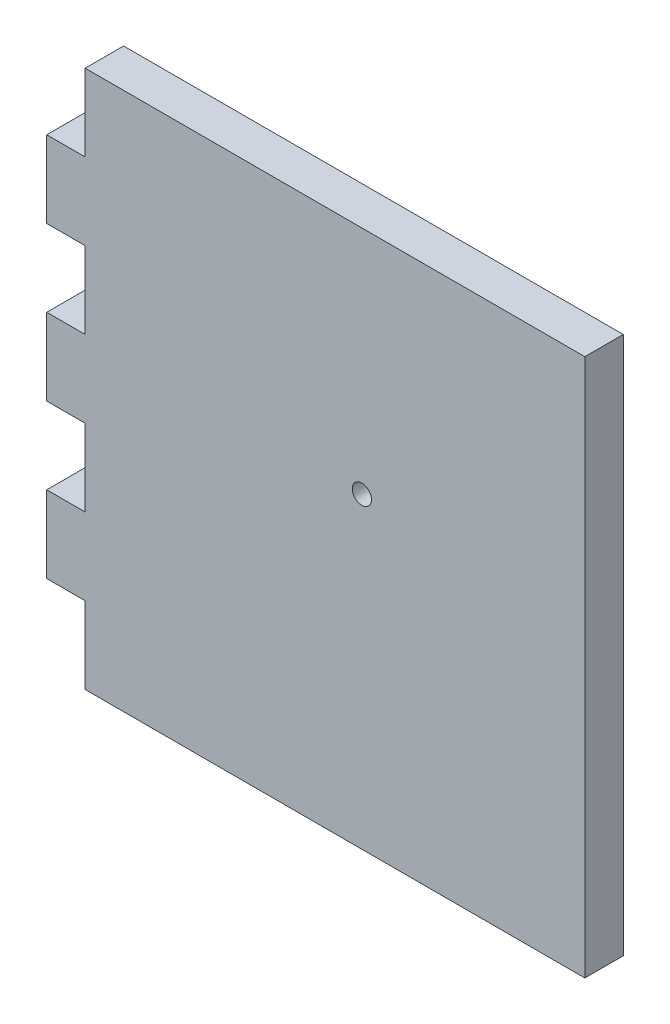
ISO-10303-21;
HEADER;
FILE_DESCRIPTION(('STEP AP214'),'2;1');
FILE_NAME('part.step','',(''),(''),'','','');
FILE_SCHEMA(('AUTOMOTIVE_DESIGN { 1 0 10303 214 1 1 1 1 }'));
ENDSEC;
DATA;
#1=APPLICATION_CONTEXT('core data for automotive mechanical design processes');
#2=APPLICATION_PROTOCOL_DEFINITION('international standard','automotive_design',2000,#1);
#3=PRODUCT_CONTEXT('',#1,'mechanical');
#4=PRODUCT('Part','Part','',(#3));
#5=PRODUCT_RELATED_PRODUCT_CATEGORY('part','',(#4));
#6=PRODUCT_DEFINITION_FORMATION('','',#4);
#7=PRODUCT_DEFINITION_CONTEXT('part definition',#1,'design');
#8=PRODUCT_DEFINITION('design','',#6,#7);
#9=PRODUCT_DEFINITION_SHAPE('','',#8);
#10=(LENGTH_UNIT() NAMED_UNIT(*) SI_UNIT(.MILLI.,.METRE.));
#11=(NAMED_UNIT(*) PLANE_ANGLE_UNIT() SI_UNIT($,.RADIAN.));
#12=(NAMED_UNIT(*) SI_UNIT($,.STERADIAN.) SOLID_ANGLE_UNIT());
#13=UNCERTAINTY_MEASURE_WITH_UNIT(LENGTH_MEASURE(1.E-05),#10,'distance_accuracy_value','');
#14=(GEOMETRIC_REPRESENTATION_CONTEXT(3) GLOBAL_UNCERTAINTY_ASSIGNED_CONTEXT((#13)) GLOBAL_UNIT_ASSIGNED_CONTEXT((#10,
#11,#12)) REPRESENTATION_CONTEXT('',''));
#15=CARTESIAN_POINT('',(0.,0.,0.));
#16=DIRECTION('',(0.,0.,1.));
#17=DIRECTION('',(1.,0.,0.));
#18=AXIS2_PLACEMENT_3D('',#15,#16,#17);
#19=CARTESIAN_POINT('',(0.,0.,12.7));
#20=DIRECTION('',(1.,0.,0.));
#21=DIRECTION('',(0.,1.,0.));
#22=AXIS2_PLACEMENT_3D('',#19,#20,#21);
#23=PLANE('',#22);
#24=DIRECTION('',(0.,-1.,0.));
#25=VECTOR('',#24,1.);
#26=CARTESIAN_POINT('',(0.,0.,12.7));
#27=LINE('',#26,#25);
#28=CARTESIAN_POINT('',(0.,-25.4,12.7));
#29=VERTEX_POINT('',#28);
#30=CARTESIAN_POINT('',(0.,-50.8,12.7));
#31=VERTEX_POINT('',#30);
#32=EDGE_CURVE('E306',#29,#31,#27,.T.);
#33=ORIENTED_EDGE('',*,*,#32,.F.);
#34=DIRECTION('',(0.,0.,1.));
#35=VECTOR('',#34,1.);
#36=CARTESIAN_POINT('',(0.,-25.4,0.));
#37=LINE('',#36,#35);
#38=CARTESIAN_POINT('',(0.,-25.4,0.));
#39=VERTEX_POINT('',#38);
#40=EDGE_CURVE('E193',#39,#29,#37,.T.);
#41=ORIENTED_EDGE('',*,*,#40,.F.);
#42=DIRECTION('',(0.,-1.,0.));
#43=VECTOR('',#42,1.);
#44=CARTESIAN_POINT('',(0.,0.,0.));
#45=LINE('',#44,#43);
#46=CARTESIAN_POINT('',(0.,-50.8,0.));
#47=VERTEX_POINT('',#46);
#48=EDGE_CURVE('E183',#39,#47,#45,.T.);
#49=ORIENTED_EDGE('',*,*,#48,.T.);
#50=DIRECTION('',(0.,0.,1.));
#51=VECTOR('',#50,1.);
#52=CARTESIAN_POINT('',(0.,-50.8,0.));
#53=LINE('',#52,#51);
#54=EDGE_CURVE('E205',#47,#31,#53,.T.);
#55=ORIENTED_EDGE('',*,*,#54,.T.);
#56=EDGE_LOOP('',(#33,#41,#49,#55));
#57=FACE_BOUND('',#56,.T.);
#58=ADVANCED_FACE('F45',(#57),#23,.F.);
#59=CARTESIAN_POINT('',(0.,-76.2,12.7));
#60=VERTEX_POINT('',#59);
#61=CARTESIAN_POINT('',(0.,-101.6,12.7));
#62=VERTEX_POINT('',#61);
#63=EDGE_CURVE('E304',#60,#62,#27,.T.);
#64=ORIENTED_EDGE('',*,*,#63,.F.);
#65=DIRECTION('',(0.,0.,1.));
#66=VECTOR('',#65,1.);
#67=CARTESIAN_POINT('',(0.,-76.2,0.));
#68=LINE('',#67,#66);
#69=CARTESIAN_POINT('',(0.,-76.2,0.));
#70=VERTEX_POINT('',#69);
#71=EDGE_CURVE('E209',#70,#60,#68,.T.);
#72=ORIENTED_EDGE('',*,*,#71,.F.);
#73=CARTESIAN_POINT('',(0.,-101.6,0.));
#74=VERTEX_POINT('',#73);
#75=EDGE_CURVE('E320',#70,#74,#45,.T.);
#76=ORIENTED_EDGE('',*,*,#75,.T.);
#77=DIRECTION('',(0.,0.,1.));
#78=VECTOR('',#77,1.);
#79=CARTESIAN_POINT('',(0.,-101.6,0.));
#80=LINE('',#79,#78);
#81=EDGE_CURVE('E239',#74,#62,#80,.T.);
#82=ORIENTED_EDGE('',*,*,#81,.T.);
#83=EDGE_LOOP('',(#64,#72,#76,#82));
#84=FACE_BOUND('',#83,.T.);
#85=ADVANCED_FACE('F372',(#84),#23,.F.);
#86=CARTESIAN_POINT('',(0.,-127.,12.7));
#87=VERTEX_POINT('',#86);
#88=CARTESIAN_POINT('',(0.,-152.4,12.7));
#89=VERTEX_POINT('',#88);
#90=EDGE_CURVE('E300',#87,#89,#27,.T.);
#91=ORIENTED_EDGE('',*,*,#90,.F.);
#92=DIRECTION('',(0.,0.,1.));
#93=VECTOR('',#92,1.);
#94=CARTESIAN_POINT('',(0.,-127.,0.));
#95=LINE('',#94,#93);
#96=CARTESIAN_POINT('',(0.,-127.,0.));
#97=VERTEX_POINT('',#96);
#98=EDGE_CURVE('E243',#97,#87,#95,.T.);
#99=ORIENTED_EDGE('',*,*,#98,.F.);
#100=CARTESIAN_POINT('',(0.,-152.4,0.));
#101=VERTEX_POINT('',#100);
#102=EDGE_CURVE('E296',#97,#101,#45,.T.);
#103=ORIENTED_EDGE('',*,*,#102,.T.);
#104=DIRECTION('',(0.,0.,1.));
#105=VECTOR('',#104,1.);
#106=CARTESIAN_POINT('',(0.,-152.4,0.));
#107=LINE('',#106,#105);
#108=EDGE_CURVE('E273',#101,#89,#107,.T.);
#109=ORIENTED_EDGE('',*,*,#108,.T.);
#110=EDGE_LOOP('',(#91,#99,#103,#109));
#111=FACE_BOUND('',#110,.T.);
#112=ADVANCED_FACE('F356',(#111),#23,.F.);
#113=CARTESIAN_POINT('',(0.,0.,12.7));
#114=DIRECTION('',(0.,-1.,0.));
#115=DIRECTION('',(0.,0.,-1.));
#116=AXIS2_PLACEMENT_3D('',#113,#114,#115);
#117=PLANE('',#116);
#118=DIRECTION('',(0.,0.,1.));
#119=VECTOR('',#118,1.);
#120=CARTESIAN_POINT('',(12.7,0.,0.));
#121=LINE('',#120,#119);
#122=CARTESIAN_POINT('',(12.7,0.,0.));
#123=VERTEX_POINT('',#122);
#124=CARTESIAN_POINT('',(12.7,0.,12.7));
#125=VERTEX_POINT('',#124);
#126=EDGE_CURVE('E163',#123,#125,#121,.T.);
#127=ORIENTED_EDGE('',*,*,#126,.T.);
#128=DIRECTION('',(-1.,0.,0.));
#129=VECTOR('',#128,1.);
#130=CARTESIAN_POINT('',(0.,0.,12.7));
#131=LINE('',#130,#129);
#132=CARTESIAN_POINT('',(177.8,0.,12.7));
#133=VERTEX_POINT('',#132);
#134=EDGE_CURVE('E313',#133,#125,#131,.T.);
#135=ORIENTED_EDGE('',*,*,#134,.F.);
#136=DIRECTION('',(0.,0.,-1.));
#137=VECTOR('',#136,1.);
#138=CARTESIAN_POINT('',(177.8,0.,12.7));
#139=LINE('',#138,#137);
#140=CARTESIAN_POINT('',(177.8,0.,0.));
#141=VERTEX_POINT('',#140);
#142=EDGE_CURVE('E53',#133,#141,#139,.T.);
#143=ORIENTED_EDGE('',*,*,#142,.T.);
#144=DIRECTION('',(-1.,0.,0.));
#145=VECTOR('',#144,1.);
#146=CARTESIAN_POINT('',(0.,0.,0.));
#147=LINE('',#146,#145);
#148=EDGE_CURVE('E305',#141,#123,#147,.T.);
#149=ORIENTED_EDGE('',*,*,#148,.T.);
#150=EDGE_LOOP('',(#127,#135,#143,#149));
#151=FACE_BOUND('',#150,.T.);
#152=ADVANCED_FACE('F333',(#151),#117,.F.);
#153=CARTESIAN_POINT('',(0.,0.,12.7));
#154=DIRECTION('',(0.,0.,1.));
#155=DIRECTION('',(1.,0.,0.));
#156=AXIS2_PLACEMENT_3D('',#153,#154,#155);
#157=PLANE('',#156);
#158=DIRECTION('',(1.,0.,0.));
#159=VECTOR('',#158,1.);
#160=CARTESIAN_POINT('',(0.,-25.4,12.7));
#161=LINE('',#160,#159);
#162=CARTESIAN_POINT('',(12.7,-25.4,12.7));
#163=VERTEX_POINT('',#162);
#164=EDGE_CURVE('E175',#29,#163,#161,.T.);
#165=ORIENTED_EDGE('',*,*,#164,.F.);
#166=ORIENTED_EDGE('',*,*,#32,.T.);
#167=DIRECTION('',(1.,0.,0.));
#168=VECTOR('',#167,1.);
#169=CARTESIAN_POINT('',(0.,-50.8,12.7));
#170=LINE('',#169,#168);
#171=CARTESIAN_POINT('',(12.7,-50.8,12.7));
#172=VERTEX_POINT('',#171);
#173=EDGE_CURVE('E213',#31,#172,#170,.T.);
#174=ORIENTED_EDGE('',*,*,#173,.T.);
#175=DIRECTION('',(0.,-1.,0.));
#176=VECTOR('',#175,1.);
#177=CARTESIAN_POINT('',(12.7,-50.8,12.7));
#178=LINE('',#177,#176);
#179=CARTESIAN_POINT('',(12.7,-76.2,12.7));
#180=VERTEX_POINT('',#179);
#181=EDGE_CURVE('E217',#172,#180,#178,.T.);
#182=ORIENTED_EDGE('',*,*,#181,.T.);
#183=DIRECTION('',(1.,0.,0.));
#184=VECTOR('',#183,1.);
#185=CARTESIAN_POINT('',(0.,-76.2,12.7));
#186=LINE('',#185,#184);
#187=EDGE_CURVE('E191',#60,#180,#186,.T.);
#188=ORIENTED_EDGE('',*,*,#187,.F.);
#189=ORIENTED_EDGE('',*,*,#63,.T.);
#190=DIRECTION('',(1.,0.,0.));
#191=VECTOR('',#190,1.);
#192=CARTESIAN_POINT('',(0.,-101.6,12.7));
#193=LINE('',#192,#191);
#194=CARTESIAN_POINT('',(12.7,-101.6,12.7));
#195=VERTEX_POINT('',#194);
#196=EDGE_CURVE('E247',#62,#195,#193,.T.);
#197=ORIENTED_EDGE('',*,*,#196,.T.);
#198=DIRECTION('',(0.,-1.,0.));
#199=VECTOR('',#198,1.);
#200=CARTESIAN_POINT('',(12.7,-101.6,12.7));
#201=LINE('',#200,#199);
#202=CARTESIAN_POINT('',(12.7,-127.,12.7));
#203=VERTEX_POINT('',#202);
#204=EDGE_CURVE('E251',#195,#203,#201,.T.);
#205=ORIENTED_EDGE('',*,*,#204,.T.);
#206=DIRECTION('',(1.,0.,0.));
#207=VECTOR('',#206,1.);
#208=CARTESIAN_POINT('',(0.,-127.,12.7));
#209=LINE('',#208,#207);
#210=EDGE_CURVE('E212',#87,#203,#209,.T.);
#211=ORIENTED_EDGE('',*,*,#210,.F.);
#212=ORIENTED_EDGE('',*,*,#90,.T.);
#213=DIRECTION('',(1.,0.,0.));
#214=VECTOR('',#213,1.);
#215=CARTESIAN_POINT('',(0.,-152.4,12.7));
#216=LINE('',#215,#214);
#217=CARTESIAN_POINT('',(12.7,-152.4,12.7));
#218=VERTEX_POINT('',#217);
#219=EDGE_CURVE('E246',#89,#218,#216,.T.);
#220=ORIENTED_EDGE('',*,*,#219,.T.);
#221=DIRECTION('',(0.,1.,0.));
#222=VECTOR('',#221,1.);
#223=CARTESIAN_POINT('',(12.7,-177.8,12.7));
#224=LINE('',#223,#222);
#225=CARTESIAN_POINT('',(12.7,-177.8,12.7));
#226=VERTEX_POINT('',#225);
#227=EDGE_CURVE('E278',#226,#218,#224,.T.);
#228=ORIENTED_EDGE('',*,*,#227,.F.);
#229=DIRECTION('',(1.,0.,0.));
#230=VECTOR('',#229,1.);
#231=CARTESIAN_POINT('',(0.,-177.8,12.7));
#232=LINE('',#231,#230);
#233=CARTESIAN_POINT('',(177.8,-177.8,12.7));
#234=VERTEX_POINT('',#233);
#235=EDGE_CURVE('E307',#226,#234,#232,.T.);
#236=ORIENTED_EDGE('',*,*,#235,.T.);
#237=DIRECTION('',(0.,1.,0.));
#238=VECTOR('',#237,1.);
#239=CARTESIAN_POINT('',(177.8,0.,12.7));
#240=LINE('',#239,#238);
#241=EDGE_CURVE('E310',#234,#133,#240,.T.);
#242=ORIENTED_EDGE('',*,*,#241,.T.);
#243=ORIENTED_EDGE('',*,*,#134,.T.);
#244=DIRECTION('',(0.,-1.,0.));
#245=VECTOR('',#244,1.);
#246=CARTESIAN_POINT('',(12.7,0.,12.7));
#247=LINE('',#246,#245);
#248=EDGE_CURVE('E185',#125,#163,#247,.T.);
#249=ORIENTED_EDGE('',*,*,#248,.T.);
#250=EDGE_LOOP('',(#165,#166,#174,#182,#188,#189,#197,#205,#211,#212,#220,#228,#236,#242,#243,#249));
#251=FACE_BOUND('',#250,.T.);
#252=CARTESIAN_POINT('',(104.14,-76.2,12.7));
#253=DIRECTION('',(0.,0.,1.));
#254=DIRECTION('',(1.,0.,0.));
#255=AXIS2_PLACEMENT_3D('',#252,#253,#254);
#256=CIRCLE('',#255,3.175);
#257=CARTESIAN_POINT('',(107.315,-76.2,12.7));
#258=VERTEX_POINT('',#257);
#259=EDGE_CURVE('E196',#258,#258,#256,.T.);
#260=ORIENTED_EDGE('',*,*,#259,.F.);
#261=EDGE_LOOP('',(#260));
#262=FACE_BOUND('',#261,.T.);
#263=ADVANCED_FACE('F348',(#251,#262),#157,.T.);
#264=CARTESIAN_POINT('',(0.,0.,0.));
#265=DIRECTION('',(0.,0.,1.));
#266=DIRECTION('',(1.,0.,0.));
#267=AXIS2_PLACEMENT_3D('',#264,#265,#266);
#268=PLANE('',#267);
#269=CARTESIAN_POINT('',(104.14,-76.2,0.));
#270=DIRECTION('',(0.,0.,1.));
#271=DIRECTION('',(1.,0.,0.));
#272=AXIS2_PLACEMENT_3D('',#269,#270,#271);
#273=CIRCLE('',#272,3.175);
#274=CARTESIAN_POINT('',(107.315,-76.2,0.));
#275=VERTEX_POINT('',#274);
#276=EDGE_CURVE('E292',#275,#275,#273,.T.);
#277=ORIENTED_EDGE('',*,*,#276,.T.);
#278=EDGE_LOOP('',(#277));
#279=FACE_BOUND('',#278,.T.);
#280=ORIENTED_EDGE('',*,*,#48,.F.);
#281=DIRECTION('',(1.,0.,0.));
#282=VECTOR('',#281,1.);
#283=CARTESIAN_POINT('',(0.,-25.4,0.));
#284=LINE('',#283,#282);
#285=CARTESIAN_POINT('',(12.7,-25.4,0.));
#286=VERTEX_POINT('',#285);
#287=EDGE_CURVE('E169',#39,#286,#284,.T.);
#288=ORIENTED_EDGE('',*,*,#287,.T.);
#289=DIRECTION('',(0.,-1.,0.));
#290=VECTOR('',#289,1.);
#291=CARTESIAN_POINT('',(12.7,0.,0.));
#292=LINE('',#291,#290);
#293=EDGE_CURVE('E157',#123,#286,#292,.T.);
#294=ORIENTED_EDGE('',*,*,#293,.F.);
#295=ORIENTED_EDGE('',*,*,#148,.F.);
#296=DIRECTION('',(0.,1.,0.));
#297=VECTOR('',#296,1.);
#298=CARTESIAN_POINT('',(177.8,0.,0.));
#299=LINE('',#298,#297);
#300=CARTESIAN_POINT('',(177.8,-177.8,0.));
#301=VERTEX_POINT('',#300);
#302=EDGE_CURVE('E324',#301,#141,#299,.T.);
#303=ORIENTED_EDGE('',*,*,#302,.F.);
#304=DIRECTION('',(1.,0.,0.));
#305=VECTOR('',#304,1.);
#306=CARTESIAN_POINT('',(0.,-177.8,0.));
#307=LINE('',#306,#305);
#308=CARTESIAN_POINT('',(12.7,-177.8,0.));
#309=VERTEX_POINT('',#308);
#310=EDGE_CURVE('E321',#309,#301,#307,.T.);
#311=ORIENTED_EDGE('',*,*,#310,.F.);
#312=DIRECTION('',(0.,1.,0.));
#313=VECTOR('',#312,1.);
#314=CARTESIAN_POINT('',(12.7,-177.8,0.));
#315=LINE('',#314,#313);
#316=CARTESIAN_POINT('',(12.7,-152.4,0.));
#317=VERTEX_POINT('',#316);
#318=EDGE_CURVE('E277',#309,#317,#315,.T.);
#319=ORIENTED_EDGE('',*,*,#318,.T.);
#320=DIRECTION('',(1.,0.,0.));
#321=VECTOR('',#320,1.);
#322=CARTESIAN_POINT('',(0.,-152.4,0.));
#323=LINE('',#322,#321);
#324=EDGE_CURVE('E282',#101,#317,#323,.T.);
#325=ORIENTED_EDGE('',*,*,#324,.F.);
#326=ORIENTED_EDGE('',*,*,#102,.F.);
#327=DIRECTION('',(1.,0.,0.));
#328=VECTOR('',#327,1.);
#329=CARTESIAN_POINT('',(0.,-127.,0.));
#330=LINE('',#329,#328);
#331=CARTESIAN_POINT('',(12.7,-127.,0.));
#332=VERTEX_POINT('',#331);
#333=EDGE_CURVE('E252',#97,#332,#330,.T.);
#334=ORIENTED_EDGE('',*,*,#333,.T.);
#335=DIRECTION('',(0.,-1.,0.));
#336=VECTOR('',#335,1.);
#337=CARTESIAN_POINT('',(12.7,-101.6,0.));
#338=LINE('',#337,#336);
#339=CARTESIAN_POINT('',(12.7,-101.6,0.));
#340=VERTEX_POINT('',#339);
#341=EDGE_CURVE('E261',#340,#332,#338,.T.);
#342=ORIENTED_EDGE('',*,*,#341,.F.);
#343=DIRECTION('',(1.,0.,0.));
#344=VECTOR('',#343,1.);
#345=CARTESIAN_POINT('',(0.,-101.6,0.));
#346=LINE('',#345,#344);
#347=EDGE_CURVE('E236',#74,#340,#346,.T.);
#348=ORIENTED_EDGE('',*,*,#347,.F.);
#349=ORIENTED_EDGE('',*,*,#75,.F.);
#350=DIRECTION('',(1.,0.,0.));
#351=VECTOR('',#350,1.);
#352=CARTESIAN_POINT('',(0.,-76.2,0.));
#353=LINE('',#352,#351);
#354=CARTESIAN_POINT('',(12.7,-76.2,0.));
#355=VERTEX_POINT('',#354);
#356=EDGE_CURVE('E218',#70,#355,#353,.T.);
#357=ORIENTED_EDGE('',*,*,#356,.T.);
#358=DIRECTION('',(0.,-1.,0.));
#359=VECTOR('',#358,1.);
#360=CARTESIAN_POINT('',(12.7,-50.8,0.));
#361=LINE('',#360,#359);
#362=CARTESIAN_POINT('',(12.7,-50.8,0.));
#363=VERTEX_POINT('',#362);
#364=EDGE_CURVE('E227',#363,#355,#361,.T.);
#365=ORIENTED_EDGE('',*,*,#364,.F.);
#366=DIRECTION('',(1.,0.,0.));
#367=VECTOR('',#366,1.);
#368=CARTESIAN_POINT('',(0.,-50.8,0.));
#369=LINE('',#368,#367);
#370=EDGE_CURVE('E202',#47,#363,#369,.T.);
#371=ORIENTED_EDGE('',*,*,#370,.F.);
#372=EDGE_LOOP('',(#280,#288,#294,#295,#303,#311,#319,#325,#326,#334,#342,#348,#349,#357,#365,#371));
#373=FACE_BOUND('',#372,.T.);
#374=ADVANCED_FACE('F180',(#279,#373),#268,.F.);
#375=CARTESIAN_POINT('',(0.,-177.8,12.7));
#376=DIRECTION('',(0.,1.,0.));
#377=DIRECTION('',(0.,0.,1.));
#378=AXIS2_PLACEMENT_3D('',#375,#376,#377);
#379=PLANE('',#378);
#380=ORIENTED_EDGE('',*,*,#235,.F.);
#381=DIRECTION('',(0.,0.,1.));
#382=VECTOR('',#381,1.);
#383=CARTESIAN_POINT('',(12.7,-177.8,0.));
#384=LINE('',#383,#382);
#385=EDGE_CURVE('E270',#309,#226,#384,.T.);
#386=ORIENTED_EDGE('',*,*,#385,.F.);
#387=ORIENTED_EDGE('',*,*,#310,.T.);
#388=DIRECTION('',(0.,0.,-1.));
#389=VECTOR('',#388,1.);
#390=CARTESIAN_POINT('',(177.8,-177.8,12.7));
#391=LINE('',#390,#389);
#392=EDGE_CURVE('E11',#234,#301,#391,.T.);
#393=ORIENTED_EDGE('',*,*,#392,.F.);
#394=EDGE_LOOP('',(#380,#386,#387,#393));
#395=FACE_BOUND('',#394,.T.);
#396=ADVANCED_FACE('F342',(#395),#379,.F.);
#397=CARTESIAN_POINT('',(177.8,0.,12.7));
#398=DIRECTION('',(-1.,0.,0.));
#399=DIRECTION('',(0.,0.,1.));
#400=AXIS2_PLACEMENT_3D('',#397,#398,#399);
#401=PLANE('',#400);
#402=ORIENTED_EDGE('',*,*,#302,.T.);
#403=ORIENTED_EDGE('',*,*,#142,.F.);
#404=ORIENTED_EDGE('',*,*,#241,.F.);
#405=ORIENTED_EDGE('',*,*,#392,.T.);
#406=EDGE_LOOP('',(#402,#403,#404,#405));
#407=FACE_BOUND('',#406,.T.);
#408=ADVANCED_FACE('F338',(#407),#401,.F.);
#409=CARTESIAN_POINT('',(104.14,-76.2,0.));
#410=DIRECTION('',(0.,0.,1.));
#411=DIRECTION('',(1.,0.,0.));
#412=AXIS2_PLACEMENT_3D('',#409,#410,#411);
#413=CYLINDRICAL_SURFACE('',#412,3.175);
#414=ORIENTED_EDGE('',*,*,#276,.F.);
#415=EDGE_LOOP('',(#414));
#416=FACE_BOUND('',#415,.T.);
#417=ORIENTED_EDGE('',*,*,#259,.T.);
#418=EDGE_LOOP('',(#417));
#419=FACE_BOUND('',#418,.T.);
#420=ADVANCED_FACE('F415',(#416,#419),#413,.F.);
#421=CARTESIAN_POINT('',(0.,-152.4,0.));
#422=DIRECTION('',(0.,-1.,0.));
#423=DIRECTION('',(0.,0.,-1.));
#424=AXIS2_PLACEMENT_3D('',#421,#422,#423);
#425=PLANE('',#424);
#426=ORIENTED_EDGE('',*,*,#219,.F.);
#427=ORIENTED_EDGE('',*,*,#108,.F.);
#428=ORIENTED_EDGE('',*,*,#324,.T.);
#429=DIRECTION('',(0.,0.,1.));
#430=VECTOR('',#429,1.);
#431=CARTESIAN_POINT('',(12.7,-152.4,0.));
#432=LINE('',#431,#430);
#433=EDGE_CURVE('E267',#317,#218,#432,.T.);
#434=ORIENTED_EDGE('',*,*,#433,.T.);
#435=EDGE_LOOP('',(#426,#427,#428,#434));
#436=FACE_BOUND('',#435,.T.);
#437=ADVANCED_FACE('F353',(#436),#425,.T.);
#438=CARTESIAN_POINT('',(12.7,-177.8,0.));
#439=DIRECTION('',(1.,0.,0.));
#440=DIRECTION('',(0.,0.,-1.));
#441=AXIS2_PLACEMENT_3D('',#438,#439,#440);
#442=PLANE('',#441);
#443=ORIENTED_EDGE('',*,*,#227,.T.);
#444=ORIENTED_EDGE('',*,*,#433,.F.);
#445=ORIENTED_EDGE('',*,*,#318,.F.);
#446=ORIENTED_EDGE('',*,*,#385,.T.);
#447=EDGE_LOOP('',(#443,#444,#445,#446));
#448=FACE_BOUND('',#447,.T.);
#449=ADVANCED_FACE('F346',(#448),#442,.F.);
#450=CARTESIAN_POINT('',(0.,-127.,0.));
#451=DIRECTION('',(0.,-1.,0.));
#452=DIRECTION('',(0.,0.,-1.));
#453=AXIS2_PLACEMENT_3D('',#450,#451,#452);
#454=PLANE('',#453);
#455=ORIENTED_EDGE('',*,*,#210,.T.);
#456=DIRECTION('',(0.,0.,1.));
#457=VECTOR('',#456,1.);
#458=CARTESIAN_POINT('',(12.7,-127.,0.));
#459=LINE('',#458,#457);
#460=EDGE_CURVE('E233',#332,#203,#459,.T.);
#461=ORIENTED_EDGE('',*,*,#460,.F.);
#462=ORIENTED_EDGE('',*,*,#333,.F.);
#463=ORIENTED_EDGE('',*,*,#98,.T.);
#464=EDGE_LOOP('',(#455,#461,#462,#463));
#465=FACE_BOUND('',#464,.T.);
#466=ADVANCED_FACE('F363',(#465),#454,.F.);
#467=CARTESIAN_POINT('',(0.,-101.6,0.));
#468=DIRECTION('',(0.,-1.,0.));
#469=DIRECTION('',(0.,0.,-1.));
#470=AXIS2_PLACEMENT_3D('',#467,#468,#469);
#471=PLANE('',#470);
#472=ORIENTED_EDGE('',*,*,#196,.F.);
#473=ORIENTED_EDGE('',*,*,#81,.F.);
#474=ORIENTED_EDGE('',*,*,#347,.T.);
#475=DIRECTION('',(0.,0.,1.));
#476=VECTOR('',#475,1.);
#477=CARTESIAN_POINT('',(12.7,-101.6,0.));
#478=LINE('',#477,#476);
#479=EDGE_CURVE('E68',#340,#195,#478,.T.);
#480=ORIENTED_EDGE('',*,*,#479,.T.);
#481=EDGE_LOOP('',(#472,#473,#474,#480));
#482=FACE_BOUND('',#481,.T.);
#483=ADVANCED_FACE('F369',(#482),#471,.T.);
#484=CARTESIAN_POINT('',(12.7,-101.6,0.));
#485=DIRECTION('',(-1.,0.,0.));
#486=DIRECTION('',(0.,-1.,0.));
#487=AXIS2_PLACEMENT_3D('',#484,#485,#486);
#488=PLANE('',#487);
#489=ORIENTED_EDGE('',*,*,#204,.F.);
#490=ORIENTED_EDGE('',*,*,#479,.F.);
#491=ORIENTED_EDGE('',*,*,#341,.T.);
#492=ORIENTED_EDGE('',*,*,#460,.T.);
#493=EDGE_LOOP('',(#489,#490,#491,#492));
#494=FACE_BOUND('',#493,.T.);
#495=ADVANCED_FACE('F364',(#494),#488,.T.);
#496=CARTESIAN_POINT('',(0.,-76.2,0.));
#497=DIRECTION('',(0.,-1.,0.));
#498=DIRECTION('',(0.,0.,-1.));
#499=AXIS2_PLACEMENT_3D('',#496,#497,#498);
#500=PLANE('',#499);
#501=ORIENTED_EDGE('',*,*,#187,.T.);
#502=DIRECTION('',(0.,0.,1.));
#503=VECTOR('',#502,1.);
#504=CARTESIAN_POINT('',(12.7,-76.2,0.));
#505=LINE('',#504,#503);
#506=EDGE_CURVE('E199',#355,#180,#505,.T.);
#507=ORIENTED_EDGE('',*,*,#506,.F.);
#508=ORIENTED_EDGE('',*,*,#356,.F.);
#509=ORIENTED_EDGE('',*,*,#71,.T.);
#510=EDGE_LOOP('',(#501,#507,#508,#509));
#511=FACE_BOUND('',#510,.T.);
#512=ADVANCED_FACE('F388',(#511),#500,.F.);
#513=CARTESIAN_POINT('',(0.,-50.8,0.));
#514=DIRECTION('',(0.,-1.,0.));
#515=DIRECTION('',(0.,0.,-1.));
#516=AXIS2_PLACEMENT_3D('',#513,#514,#515);
#517=PLANE('',#516);
#518=ORIENTED_EDGE('',*,*,#173,.F.);
#519=ORIENTED_EDGE('',*,*,#54,.F.);
#520=ORIENTED_EDGE('',*,*,#370,.T.);
#521=DIRECTION('',(0.,0.,1.));
#522=VECTOR('',#521,1.);
#523=CARTESIAN_POINT('',(12.7,-50.8,0.));
#524=LINE('',#523,#522);
#525=EDGE_CURVE('E60',#363,#172,#524,.T.);
#526=ORIENTED_EDGE('',*,*,#525,.T.);
#527=EDGE_LOOP('',(#518,#519,#520,#526));
#528=FACE_BOUND('',#527,.T.);
#529=ADVANCED_FACE('F383',(#528),#517,.T.);
#530=CARTESIAN_POINT('',(12.7,-50.8,0.));
#531=DIRECTION('',(-1.,0.,0.));
#532=DIRECTION('',(0.,-1.,0.));
#533=AXIS2_PLACEMENT_3D('',#530,#531,#532);
#534=PLANE('',#533);
#535=ORIENTED_EDGE('',*,*,#181,.F.);
#536=ORIENTED_EDGE('',*,*,#525,.F.);
#537=ORIENTED_EDGE('',*,*,#364,.T.);
#538=ORIENTED_EDGE('',*,*,#506,.T.);
#539=EDGE_LOOP('',(#535,#536,#537,#538));
#540=FACE_BOUND('',#539,.T.);
#541=ADVANCED_FACE('F385',(#540),#534,.T.);
#542=CARTESIAN_POINT('',(0.,-25.4,0.));
#543=DIRECTION('',(0.,-1.,0.));
#544=DIRECTION('',(0.,0.,-1.));
#545=AXIS2_PLACEMENT_3D('',#542,#543,#544);
#546=PLANE('',#545);
#547=ORIENTED_EDGE('',*,*,#164,.T.);
#548=DIRECTION('',(0.,0.,1.));
#549=VECTOR('',#548,1.);
#550=CARTESIAN_POINT('',(12.7,-25.4,0.));
#551=LINE('',#550,#549);
#552=EDGE_CURVE('E160',#286,#163,#551,.T.);
#553=ORIENTED_EDGE('',*,*,#552,.F.);
#554=ORIENTED_EDGE('',*,*,#287,.F.);
#555=ORIENTED_EDGE('',*,*,#40,.T.);
#556=EDGE_LOOP('',(#547,#553,#554,#555));
#557=FACE_BOUND('',#556,.T.);
#558=ADVANCED_FACE('F172',(#557),#546,.F.);
#559=CARTESIAN_POINT('',(12.7,0.,0.));
#560=DIRECTION('',(-1.,0.,0.));
#561=DIRECTION('',(0.,-1.,0.));
#562=AXIS2_PLACEMENT_3D('',#559,#560,#561);
#563=PLANE('',#562);
#564=ORIENTED_EDGE('',*,*,#248,.F.);
#565=ORIENTED_EDGE('',*,*,#126,.F.);
#566=ORIENTED_EDGE('',*,*,#293,.T.);
#567=ORIENTED_EDGE('',*,*,#552,.T.);
#568=EDGE_LOOP('',(#564,#565,#566,#567));
#569=FACE_BOUND('',#568,.T.);
#570=ADVANCED_FACE('F159',(#569),#563,.T.);
#571=CLOSED_SHELL('',(#58,#85,#112,#152,#263,#374,#396,#408,#420,#437,#449,#466,#483,#495,#512,
#529,#541,#558,#570));
#572=MANIFOLD_SOLID_BREP('B2',#571);
#573=ADVANCED_BREP_SHAPE_REPRESENTATION('',(#18,#572),#14);
#574=SHAPE_DEFINITION_REPRESENTATION(#9,#573);
ENDSEC;
END-ISO-10303-21;
